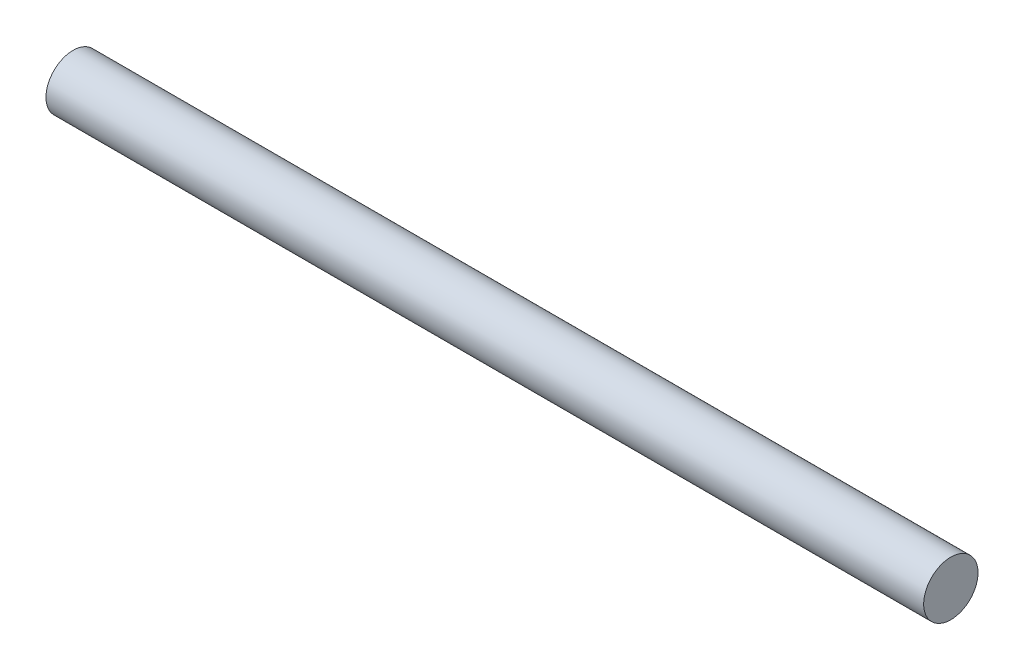
ISO-10303-21;
HEADER;
FILE_DESCRIPTION(('STEP AP214'),'2;1');
FILE_NAME('part.step','',(''),(''),'','','');
FILE_SCHEMA(('AUTOMOTIVE_DESIGN { 1 0 10303 214 1 1 1 1 }'));
ENDSEC;
DATA;
#1=APPLICATION_CONTEXT('core data for automotive mechanical design processes');
#2=APPLICATION_PROTOCOL_DEFINITION('international standard','automotive_design',2000,#1);
#3=PRODUCT_CONTEXT('',#1,'mechanical');
#4=PRODUCT('Part','Part','',(#3));
#5=PRODUCT_RELATED_PRODUCT_CATEGORY('part','',(#4));
#6=PRODUCT_DEFINITION_FORMATION('','',#4);
#7=PRODUCT_DEFINITION_CONTEXT('part definition',#1,'design');
#8=PRODUCT_DEFINITION('design','',#6,#7);
#9=PRODUCT_DEFINITION_SHAPE('','',#8);
#10=(LENGTH_UNIT() NAMED_UNIT(*) SI_UNIT(.MILLI.,.METRE.));
#11=(NAMED_UNIT(*) PLANE_ANGLE_UNIT() SI_UNIT($,.RADIAN.));
#12=(NAMED_UNIT(*) SI_UNIT($,.STERADIAN.) SOLID_ANGLE_UNIT());
#13=UNCERTAINTY_MEASURE_WITH_UNIT(LENGTH_MEASURE(1.E-05),#10,'distance_accuracy_value','');
#14=(GEOMETRIC_REPRESENTATION_CONTEXT(3) GLOBAL_UNCERTAINTY_ASSIGNED_CONTEXT((#13)) GLOBAL_UNIT_ASSIGNED_CONTEXT((#10,
#11,#12)) REPRESENTATION_CONTEXT('',''));
#15=CARTESIAN_POINT('',(0.,0.,0.));
#16=DIRECTION('',(0.,0.,1.));
#17=DIRECTION('',(1.,0.,0.));
#18=AXIS2_PLACEMENT_3D('',#15,#16,#17);
#19=CARTESIAN_POINT('',(533.4,0.,0.));
#20=DIRECTION('',(-1.,0.,0.));
#21=DIRECTION('',(0.,0.,1.));
#22=AXIS2_PLACEMENT_3D('',#19,#20,#21);
#23=CYLINDRICAL_SURFACE('',#22,16.51);
#24=CARTESIAN_POINT('',(533.4,0.,0.));
#25=DIRECTION('',(1.,0.,0.));
#26=DIRECTION('',(0.,0.,-1.));
#27=AXIS2_PLACEMENT_3D('',#24,#25,#26);
#28=CIRCLE('',#27,16.51);
#29=CARTESIAN_POINT('',(533.4,0.,-16.51));
#30=VERTEX_POINT('',#29);
#31=EDGE_CURVE('E10',#30,#30,#28,.T.);
#32=ORIENTED_EDGE('',*,*,#31,.F.);
#33=EDGE_LOOP('',(#32));
#34=FACE_BOUND('',#33,.T.);
#35=CARTESIAN_POINT('',(0.,0.,0.));
#36=DIRECTION('',(1.,0.,0.));
#37=DIRECTION('',(0.,0.,-1.));
#38=AXIS2_PLACEMENT_3D('',#35,#36,#37);
#39=CIRCLE('',#38,16.51);
#40=CARTESIAN_POINT('',(0.,0.,-16.51));
#41=VERTEX_POINT('',#40);
#42=EDGE_CURVE('E34',#41,#41,#39,.T.);
#43=ORIENTED_EDGE('',*,*,#42,.T.);
#44=EDGE_LOOP('',(#43));
#45=FACE_BOUND('',#44,.T.);
#46=ADVANCED_FACE('F31',(#34,#45),#23,.T.);
#47=CARTESIAN_POINT('',(533.4,0.,0.));
#48=DIRECTION('',(1.,0.,0.));
#49=DIRECTION('',(0.,0.,-1.));
#50=AXIS2_PLACEMENT_3D('',#47,#48,#49);
#51=PLANE('',#50);
#52=ORIENTED_EDGE('',*,*,#31,.T.);
#53=EDGE_LOOP('',(#52));
#54=FACE_BOUND('',#53,.T.);
#55=ADVANCED_FACE('F46',(#54),#51,.T.);
#56=CARTESIAN_POINT('',(0.,0.,0.));
#57=DIRECTION('',(1.,0.,0.));
#58=DIRECTION('',(0.,0.,-1.));
#59=AXIS2_PLACEMENT_3D('',#56,#57,#58);
#60=PLANE('',#59);
#61=ORIENTED_EDGE('',*,*,#42,.F.);
#62=EDGE_LOOP('',(#61));
#63=FACE_BOUND('',#62,.T.);
#64=ADVANCED_FACE('F44',(#63),#60,.F.);
#65=CLOSED_SHELL('',(#46,#55,#64));
#66=MANIFOLD_SOLID_BREP('B2',#65);
#67=ADVANCED_BREP_SHAPE_REPRESENTATION('',(#18,#66),#14);
#68=SHAPE_DEFINITION_REPRESENTATION(#9,#67);
ENDSEC;
END-ISO-10303-21;
